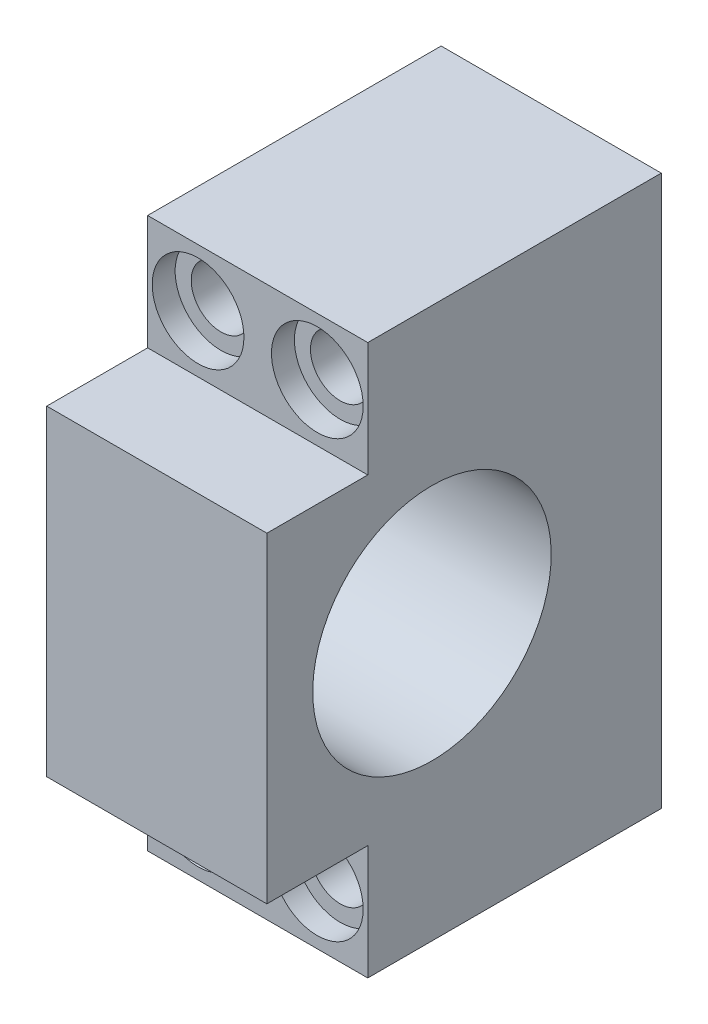
ISO-10303-21;
HEADER;
FILE_DESCRIPTION(('STEP AP214'),'2;1');
FILE_NAME('part.step','',(''),(''),'','','');
FILE_SCHEMA(('AUTOMOTIVE_DESIGN { 1 0 10303 214 1 1 1 1 }'));
ENDSEC;
DATA;
#1=APPLICATION_CONTEXT('core data for automotive mechanical design processes');
#2=APPLICATION_PROTOCOL_DEFINITION('international standard','automotive_design',2000,#1);
#3=PRODUCT_CONTEXT('',#1,'mechanical');
#4=PRODUCT('Part','Part','',(#3));
#5=PRODUCT_RELATED_PRODUCT_CATEGORY('part','',(#4));
#6=PRODUCT_DEFINITION_FORMATION('','',#4);
#7=PRODUCT_DEFINITION_CONTEXT('part definition',#1,'design');
#8=PRODUCT_DEFINITION('design','',#6,#7);
#9=PRODUCT_DEFINITION_SHAPE('','',#8);
#10=(LENGTH_UNIT() NAMED_UNIT(*) SI_UNIT(.MILLI.,.METRE.));
#11=(NAMED_UNIT(*) PLANE_ANGLE_UNIT() SI_UNIT($,.RADIAN.));
#12=(NAMED_UNIT(*) SI_UNIT($,.STERADIAN.) SOLID_ANGLE_UNIT());
#13=UNCERTAINTY_MEASURE_WITH_UNIT(LENGTH_MEASURE(1.E-05),#10,'distance_accuracy_value','');
#14=(GEOMETRIC_REPRESENTATION_CONTEXT(3) GLOBAL_UNCERTAINTY_ASSIGNED_CONTEXT((#13)) GLOBAL_UNIT_ASSIGNED_CONTEXT((#10,
#11,#12)) REPRESENTATION_CONTEXT('',''));
#15=CARTESIAN_POINT('',(0.,0.,0.));
#16=DIRECTION('',(0.,0.,1.));
#17=DIRECTION('',(1.,0.,0.));
#18=AXIS2_PLACEMENT_3D('',#15,#16,#17);
#19=CARTESIAN_POINT('',(-6.5,-23.75,0.));
#20=DIRECTION('',(0.,0.,1.));
#21=DIRECTION('',(1.,0.,0.));
#22=AXIS2_PLACEMENT_3D('',#19,#20,#21);
#23=CYLINDRICAL_SURFACE('',#22,3.25);
#24=CARTESIAN_POINT('',(-6.5,-23.75,0.));
#25=DIRECTION('',(0.,0.,1.));
#26=DIRECTION('',(1.,0.,0.));
#27=AXIS2_PLACEMENT_3D('',#24,#25,#26);
#28=CIRCLE('',#27,3.25);
#29=CARTESIAN_POINT('',(-3.25,-23.75,0.));
#30=VERTEX_POINT('',#29);
#31=EDGE_CURVE('E181',#30,#30,#28,.T.);
#32=ORIENTED_EDGE('',*,*,#31,.F.);
#33=EDGE_LOOP('',(#32));
#34=FACE_BOUND('',#33,.T.);
#35=CARTESIAN_POINT('',(-6.5,-23.75,29.5));
#36=DIRECTION('',(0.,0.,1.));
#37=DIRECTION('',(1.,0.,0.));
#38=AXIS2_PLACEMENT_3D('',#35,#36,#37);
#39=CIRCLE('',#38,3.25);
#40=CARTESIAN_POINT('',(-3.25,-23.75,29.5));
#41=VERTEX_POINT('',#40);
#42=EDGE_CURVE('E48',#41,#41,#39,.F.);
#43=ORIENTED_EDGE('',*,*,#42,.F.);
#44=EDGE_LOOP('',(#43));
#45=FACE_BOUND('',#44,.T.);
#46=ADVANCED_FACE('F44',(#34,#45),#23,.F.);
#47=CARTESIAN_POINT('',(6.5,-23.75,0.));
#48=DIRECTION('',(0.,0.,1.));
#49=DIRECTION('',(1.,0.,0.));
#50=AXIS2_PLACEMENT_3D('',#47,#48,#49);
#51=CYLINDRICAL_SURFACE('',#50,3.25);
#52=CARTESIAN_POINT('',(6.5,-23.75,0.));
#53=DIRECTION('',(0.,0.,1.));
#54=DIRECTION('',(1.,0.,0.));
#55=AXIS2_PLACEMENT_3D('',#52,#53,#54);
#56=CIRCLE('',#55,3.25);
#57=CARTESIAN_POINT('',(9.75000000000001,-23.75,0.));
#58=VERTEX_POINT('',#57);
#59=EDGE_CURVE('E173',#58,#58,#56,.T.);
#60=ORIENTED_EDGE('',*,*,#59,.F.);
#61=EDGE_LOOP('',(#60));
#62=FACE_BOUND('',#61,.T.);
#63=CARTESIAN_POINT('',(6.5,-23.75,29.5));
#64=DIRECTION('',(0.,0.,1.));
#65=DIRECTION('',(1.,0.,0.));
#66=AXIS2_PLACEMENT_3D('',#63,#64,#65);
#67=CIRCLE('',#66,3.25);
#68=CARTESIAN_POINT('',(9.75000000000001,-23.75,29.5));
#69=VERTEX_POINT('',#68);
#70=EDGE_CURVE('E155',#69,#69,#67,.F.);
#71=ORIENTED_EDGE('',*,*,#70,.F.);
#72=EDGE_LOOP('',(#71));
#73=FACE_BOUND('',#72,.T.);
#74=ADVANCED_FACE('F271',(#62,#73),#51,.F.);
#75=CARTESIAN_POINT('',(6.5,23.75,0.));
#76=DIRECTION('',(0.,0.,1.));
#77=DIRECTION('',(1.,0.,0.));
#78=AXIS2_PLACEMENT_3D('',#75,#76,#77);
#79=CYLINDRICAL_SURFACE('',#78,3.25);
#80=CARTESIAN_POINT('',(6.5,23.75,0.));
#81=DIRECTION('',(0.,0.,1.));
#82=DIRECTION('',(1.,0.,0.));
#83=AXIS2_PLACEMENT_3D('',#80,#81,#82);
#84=CIRCLE('',#83,3.25);
#85=CARTESIAN_POINT('',(9.75000000000001,23.75,0.));
#86=VERTEX_POINT('',#85);
#87=EDGE_CURVE('E162',#86,#86,#84,.T.);
#88=ORIENTED_EDGE('',*,*,#87,.F.);
#89=EDGE_LOOP('',(#88));
#90=FACE_BOUND('',#89,.T.);
#91=CARTESIAN_POINT('',(6.5,23.75,29.5));
#92=DIRECTION('',(0.,0.,1.));
#93=DIRECTION('',(1.,0.,0.));
#94=AXIS2_PLACEMENT_3D('',#91,#92,#93);
#95=CIRCLE('',#94,3.25);
#96=CARTESIAN_POINT('',(9.75000000000001,23.75,29.5));
#97=VERTEX_POINT('',#96);
#98=EDGE_CURVE('E151',#97,#97,#95,.F.);
#99=ORIENTED_EDGE('',*,*,#98,.F.);
#100=EDGE_LOOP('',(#99));
#101=FACE_BOUND('',#100,.T.);
#102=ADVANCED_FACE('F266',(#90,#101),#79,.F.);
#103=CARTESIAN_POINT('',(-6.5,23.75,0.));
#104=DIRECTION('',(0.,0.,1.));
#105=DIRECTION('',(1.,0.,0.));
#106=AXIS2_PLACEMENT_3D('',#103,#104,#105);
#107=CYLINDRICAL_SURFACE('',#106,3.25);
#108=CARTESIAN_POINT('',(-6.5,23.75,0.));
#109=DIRECTION('',(0.,0.,1.));
#110=DIRECTION('',(1.,0.,0.));
#111=AXIS2_PLACEMENT_3D('',#108,#109,#110);
#112=CIRCLE('',#111,3.25);
#113=CARTESIAN_POINT('',(-3.25,23.75,0.));
#114=VERTEX_POINT('',#113);
#115=EDGE_CURVE('E167',#114,#114,#112,.T.);
#116=ORIENTED_EDGE('',*,*,#115,.F.);
#117=EDGE_LOOP('',(#116));
#118=FACE_BOUND('',#117,.T.);
#119=CARTESIAN_POINT('',(-6.5,23.75,29.5));
#120=DIRECTION('',(0.,0.,1.));
#121=DIRECTION('',(1.,0.,0.));
#122=AXIS2_PLACEMENT_3D('',#119,#120,#121);
#123=CIRCLE('',#122,3.25);
#124=CARTESIAN_POINT('',(-3.25,23.75,29.5));
#125=VERTEX_POINT('',#124);
#126=EDGE_CURVE('E147',#125,#125,#123,.F.);
#127=ORIENTED_EDGE('',*,*,#126,.F.);
#128=EDGE_LOOP('',(#127));
#129=FACE_BOUND('',#128,.T.);
#130=ADVANCED_FACE('F259',(#118,#129),#107,.F.);
#131=CARTESIAN_POINT('',(-12.,30.,43.));
#132=DIRECTION('',(0.,-1.,0.));
#133=DIRECTION('',(0.,0.,-1.));
#134=AXIS2_PLACEMENT_3D('',#131,#132,#133);
#135=PLANE('',#134);
#136=DIRECTION('',(-1.,0.,0.));
#137=VECTOR('',#136,1.);
#138=CARTESIAN_POINT('',(-12.,30.,32.));
#139=LINE('',#138,#137);
#140=CARTESIAN_POINT('',(12.,30.,32.));
#141=VERTEX_POINT('',#140);
#142=CARTESIAN_POINT('',(-12.,30.,32.));
#143=VERTEX_POINT('',#142);
#144=EDGE_CURVE('E202',#141,#143,#139,.T.);
#145=ORIENTED_EDGE('',*,*,#144,.F.);
#146=DIRECTION('',(0.,0.,-1.));
#147=VECTOR('',#146,1.);
#148=CARTESIAN_POINT('',(12.,30.,43.));
#149=LINE('',#148,#147);
#150=CARTESIAN_POINT('',(12.,30.,0.));
#151=VERTEX_POINT('',#150);
#152=EDGE_CURVE('E11',#141,#151,#149,.T.);
#153=ORIENTED_EDGE('',*,*,#152,.T.);
#154=DIRECTION('',(-1.,0.,0.));
#155=VECTOR('',#154,1.);
#156=CARTESIAN_POINT('',(-12.,30.,0.));
#157=LINE('',#156,#155);
#158=CARTESIAN_POINT('',(-12.,30.,0.));
#159=VERTEX_POINT('',#158);
#160=EDGE_CURVE('E232',#151,#159,#157,.T.);
#161=ORIENTED_EDGE('',*,*,#160,.T.);
#162=DIRECTION('',(0.,0.,-1.));
#163=VECTOR('',#162,1.);
#164=CARTESIAN_POINT('',(-12.,30.,43.));
#165=LINE('',#164,#163);
#166=EDGE_CURVE('E54',#143,#159,#165,.T.);
#167=ORIENTED_EDGE('',*,*,#166,.F.);
#168=EDGE_LOOP('',(#145,#153,#161,#167));
#169=FACE_BOUND('',#168,.T.);
#170=ADVANCED_FACE('F257',(#169),#135,.F.);
#171=CARTESIAN_POINT('',(12.,30.,43.));
#172=DIRECTION('',(-1.,0.,0.));
#173=DIRECTION('',(0.,-1.,0.));
#174=AXIS2_PLACEMENT_3D('',#171,#172,#173);
#175=PLANE('',#174);
#176=CARTESIAN_POINT('',(12.,0.,25.));
#177=DIRECTION('',(1.,0.,0.));
#178=DIRECTION('',(0.,1.,0.));
#179=AXIS2_PLACEMENT_3D('',#176,#177,#178);
#180=CIRCLE('',#179,13.);
#181=CARTESIAN_POINT('',(12.,13.,25.));
#182=VERTEX_POINT('',#181);
#183=EDGE_CURVE('E309',#182,#182,#180,.T.);
#184=ORIENTED_EDGE('',*,*,#183,.F.);
#185=EDGE_LOOP('',(#184));
#186=FACE_BOUND('',#185,.T.);
#187=DIRECTION('',(0.,1.,0.));
#188=VECTOR('',#187,1.);
#189=CARTESIAN_POINT('',(12.,30.,43.));
#190=LINE('',#189,#188);
#191=CARTESIAN_POINT('',(12.,-17.5,43.));
#192=VERTEX_POINT('',#191);
#193=CARTESIAN_POINT('',(12.,17.5,43.));
#194=VERTEX_POINT('',#193);
#195=EDGE_CURVE('E221',#192,#194,#190,.T.);
#196=ORIENTED_EDGE('',*,*,#195,.F.);
#197=DIRECTION('',(0.,0.,1.));
#198=VECTOR('',#197,1.);
#199=CARTESIAN_POINT('',(12.,-17.5,32.));
#200=LINE('',#199,#198);
#201=CARTESIAN_POINT('',(12.,-17.5,32.));
#202=VERTEX_POINT('',#201);
#203=EDGE_CURVE('E70',#202,#192,#200,.T.);
#204=ORIENTED_EDGE('',*,*,#203,.F.);
#205=DIRECTION('',(0.,1.,0.));
#206=VECTOR('',#205,1.);
#207=CARTESIAN_POINT('',(12.,-30.,32.));
#208=LINE('',#207,#206);
#209=CARTESIAN_POINT('',(12.,-30.,32.));
#210=VERTEX_POINT('',#209);
#211=EDGE_CURVE('E132',#210,#202,#208,.T.);
#212=ORIENTED_EDGE('',*,*,#211,.F.);
#213=DIRECTION('',(0.,0.,-1.));
#214=VECTOR('',#213,1.);
#215=CARTESIAN_POINT('',(12.,-30.,43.));
#216=LINE('',#215,#214);
#217=CARTESIAN_POINT('',(12.,-30.,0.));
#218=VERTEX_POINT('',#217);
#219=EDGE_CURVE('E130',#210,#218,#216,.T.);
#220=ORIENTED_EDGE('',*,*,#219,.T.);
#221=DIRECTION('',(0.,1.,0.));
#222=VECTOR('',#221,1.);
#223=CARTESIAN_POINT('',(12.,30.,0.));
#224=LINE('',#223,#222);
#225=EDGE_CURVE('E197',#218,#151,#224,.T.);
#226=ORIENTED_EDGE('',*,*,#225,.T.);
#227=ORIENTED_EDGE('',*,*,#152,.F.);
#228=DIRECTION('',(0.,1.,0.));
#229=VECTOR('',#228,1.);
#230=CARTESIAN_POINT('',(12.,30.,32.));
#231=LINE('',#230,#229);
#232=CARTESIAN_POINT('',(12.,17.5,32.));
#233=VERTEX_POINT('',#232);
#234=EDGE_CURVE('E211',#233,#141,#231,.T.);
#235=ORIENTED_EDGE('',*,*,#234,.F.);
#236=DIRECTION('',(0.,0.,1.));
#237=VECTOR('',#236,1.);
#238=CARTESIAN_POINT('',(12.,17.5,32.));
#239=LINE('',#238,#237);
#240=EDGE_CURVE('E185',#233,#194,#239,.T.);
#241=ORIENTED_EDGE('',*,*,#240,.T.);
#242=EDGE_LOOP('',(#196,#204,#212,#220,#226,#227,#235,#241));
#243=FACE_BOUND('',#242,.T.);
#244=ADVANCED_FACE('F46',(#186,#243),#175,.F.);
#245=CARTESIAN_POINT('',(-12.,30.,43.));
#246=DIRECTION('',(1.,0.,0.));
#247=DIRECTION('',(0.,1.,0.));
#248=AXIS2_PLACEMENT_3D('',#245,#246,#247);
#249=PLANE('',#248);
#250=CARTESIAN_POINT('',(-12.,0.,25.));
#251=DIRECTION('',(1.,0.,0.));
#252=DIRECTION('',(0.,1.,0.));
#253=AXIS2_PLACEMENT_3D('',#250,#251,#252);
#254=CIRCLE('',#253,13.);
#255=CARTESIAN_POINT('',(-12.,13.,25.));
#256=VERTEX_POINT('',#255);
#257=EDGE_CURVE('E305',#256,#256,#254,.T.);
#258=ORIENTED_EDGE('',*,*,#257,.T.);
#259=EDGE_LOOP('',(#258));
#260=FACE_BOUND('',#259,.T.);
#261=DIRECTION('',(0.,-1.,0.));
#262=VECTOR('',#261,1.);
#263=CARTESIAN_POINT('',(-12.,-30.,32.));
#264=LINE('',#263,#262);
#265=CARTESIAN_POINT('',(-12.,-17.5,32.));
#266=VERTEX_POINT('',#265);
#267=CARTESIAN_POINT('',(-12.,-30.,32.));
#268=VERTEX_POINT('',#267);
#269=EDGE_CURVE('E112',#266,#268,#264,.T.);
#270=ORIENTED_EDGE('',*,*,#269,.F.);
#271=DIRECTION('',(0.,0.,1.));
#272=VECTOR('',#271,1.);
#273=CARTESIAN_POINT('',(-12.,-17.5,32.));
#274=LINE('',#273,#272);
#275=CARTESIAN_POINT('',(-12.,-17.5,43.));
#276=VERTEX_POINT('',#275);
#277=EDGE_CURVE('E194',#266,#276,#274,.T.);
#278=ORIENTED_EDGE('',*,*,#277,.T.);
#279=DIRECTION('',(0.,-1.,0.));
#280=VECTOR('',#279,1.);
#281=CARTESIAN_POINT('',(-12.,30.,43.));
#282=LINE('',#281,#280);
#283=CARTESIAN_POINT('',(-12.,17.5,43.));
#284=VERTEX_POINT('',#283);
#285=EDGE_CURVE('E143',#284,#276,#282,.T.);
#286=ORIENTED_EDGE('',*,*,#285,.F.);
#287=DIRECTION('',(0.,0.,1.));
#288=VECTOR('',#287,1.);
#289=CARTESIAN_POINT('',(-12.,17.5,32.));
#290=LINE('',#289,#288);
#291=CARTESIAN_POINT('',(-12.,17.5,32.));
#292=VERTEX_POINT('',#291);
#293=EDGE_CURVE('E62',#292,#284,#290,.T.);
#294=ORIENTED_EDGE('',*,*,#293,.F.);
#295=DIRECTION('',(0.,-1.,0.));
#296=VECTOR('',#295,1.);
#297=CARTESIAN_POINT('',(-12.,30.,32.));
#298=LINE('',#297,#296);
#299=EDGE_CURVE('E208',#143,#292,#298,.T.);
#300=ORIENTED_EDGE('',*,*,#299,.F.);
#301=ORIENTED_EDGE('',*,*,#166,.T.);
#302=DIRECTION('',(0.,-1.,0.));
#303=VECTOR('',#302,1.);
#304=CARTESIAN_POINT('',(-12.,30.,0.));
#305=LINE('',#304,#303);
#306=CARTESIAN_POINT('',(-12.,-30.,0.));
#307=VERTEX_POINT('',#306);
#308=EDGE_CURVE('E136',#159,#307,#305,.T.);
#309=ORIENTED_EDGE('',*,*,#308,.T.);
#310=DIRECTION('',(0.,0.,-1.));
#311=VECTOR('',#310,1.);
#312=CARTESIAN_POINT('',(-12.,-30.,43.));
#313=LINE('',#312,#311);
#314=EDGE_CURVE('E128',#268,#307,#313,.T.);
#315=ORIENTED_EDGE('',*,*,#314,.F.);
#316=EDGE_LOOP('',(#270,#278,#286,#294,#300,#301,#309,#315));
#317=FACE_BOUND('',#316,.T.);
#318=ADVANCED_FACE('F134',(#260,#317),#249,.F.);
#319=CARTESIAN_POINT('',(-12.,-30.,43.));
#320=DIRECTION('',(0.,1.,0.));
#321=DIRECTION('',(0.,0.,1.));
#322=AXIS2_PLACEMENT_3D('',#319,#320,#321);
#323=PLANE('',#322);
#324=ORIENTED_EDGE('',*,*,#219,.F.);
#325=DIRECTION('',(1.,0.,0.));
#326=VECTOR('',#325,1.);
#327=CARTESIAN_POINT('',(-12.,-30.,32.));
#328=LINE('',#327,#326);
#329=EDGE_CURVE('E115',#268,#210,#328,.T.);
#330=ORIENTED_EDGE('',*,*,#329,.F.);
#331=ORIENTED_EDGE('',*,*,#314,.T.);
#332=DIRECTION('',(1.,0.,0.));
#333=VECTOR('',#332,1.);
#334=CARTESIAN_POINT('',(-12.,-30.,0.));
#335=LINE('',#334,#333);
#336=EDGE_CURVE('E225',#307,#218,#335,.T.);
#337=ORIENTED_EDGE('',*,*,#336,.T.);
#338=EDGE_LOOP('',(#324,#330,#331,#337));
#339=FACE_BOUND('',#338,.T.);
#340=ADVANCED_FACE('F126',(#339),#323,.F.);
#341=CARTESIAN_POINT('',(0.,0.,43.));
#342=DIRECTION('',(0.,0.,1.));
#343=DIRECTION('',(1.,0.,0.));
#344=AXIS2_PLACEMENT_3D('',#341,#342,#343);
#345=PLANE('',#344);
#346=DIRECTION('',(-1.,0.,0.));
#347=VECTOR('',#346,1.);
#348=CARTESIAN_POINT('',(-12.,-17.5,43.));
#349=LINE('',#348,#347);
#350=EDGE_CURVE('E122',#192,#276,#349,.T.);
#351=ORIENTED_EDGE('',*,*,#350,.F.);
#352=ORIENTED_EDGE('',*,*,#195,.T.);
#353=DIRECTION('',(1.,0.,0.));
#354=VECTOR('',#353,1.);
#355=CARTESIAN_POINT('',(-12.,17.5,43.));
#356=LINE('',#355,#354);
#357=EDGE_CURVE('E193',#284,#194,#356,.T.);
#358=ORIENTED_EDGE('',*,*,#357,.F.);
#359=ORIENTED_EDGE('',*,*,#285,.T.);
#360=EDGE_LOOP('',(#351,#352,#358,#359));
#361=FACE_BOUND('',#360,.T.);
#362=ADVANCED_FACE('F249',(#361),#345,.T.);
#363=CARTESIAN_POINT('',(0.,0.,0.));
#364=DIRECTION('',(0.,0.,1.));
#365=DIRECTION('',(1.,0.,0.));
#366=AXIS2_PLACEMENT_3D('',#363,#364,#365);
#367=PLANE('',#366);
#368=ORIENTED_EDGE('',*,*,#59,.T.);
#369=EDGE_LOOP('',(#368));
#370=FACE_BOUND('',#369,.T.);
#371=ORIENTED_EDGE('',*,*,#115,.T.);
#372=EDGE_LOOP('',(#371));
#373=FACE_BOUND('',#372,.T.);
#374=ORIENTED_EDGE('',*,*,#87,.T.);
#375=EDGE_LOOP('',(#374));
#376=FACE_BOUND('',#375,.T.);
#377=ORIENTED_EDGE('',*,*,#31,.T.);
#378=EDGE_LOOP('',(#377));
#379=FACE_BOUND('',#378,.T.);
#380=ORIENTED_EDGE('',*,*,#225,.F.);
#381=ORIENTED_EDGE('',*,*,#336,.F.);
#382=ORIENTED_EDGE('',*,*,#308,.F.);
#383=ORIENTED_EDGE('',*,*,#160,.F.);
#384=EDGE_LOOP('',(#380,#381,#382,#383));
#385=FACE_BOUND('',#384,.T.);
#386=ADVANCED_FACE('F241',(#370,#373,#376,#379,#385),#367,.F.);
#387=CARTESIAN_POINT('',(-12.,17.5,32.));
#388=DIRECTION('',(0.,-1.,0.));
#389=DIRECTION('',(1.,0.,0.));
#390=AXIS2_PLACEMENT_3D('',#387,#388,#389);
#391=PLANE('',#390);
#392=ORIENTED_EDGE('',*,*,#357,.T.);
#393=ORIENTED_EDGE('',*,*,#240,.F.);
#394=DIRECTION('',(1.,0.,0.));
#395=VECTOR('',#394,1.);
#396=CARTESIAN_POINT('',(-12.,17.5,32.));
#397=LINE('',#396,#395);
#398=EDGE_CURVE('E214',#292,#233,#397,.T.);
#399=ORIENTED_EDGE('',*,*,#398,.F.);
#400=ORIENTED_EDGE('',*,*,#293,.T.);
#401=EDGE_LOOP('',(#392,#393,#399,#400));
#402=FACE_BOUND('',#401,.T.);
#403=ADVANCED_FACE('F250',(#402),#391,.F.);
#404=CARTESIAN_POINT('',(0.,0.,32.));
#405=DIRECTION('',(0.,0.,1.));
#406=DIRECTION('',(1.,0.,0.));
#407=AXIS2_PLACEMENT_3D('',#404,#405,#406);
#408=PLANE('',#407);
#409=CARTESIAN_POINT('',(6.5,23.75,32.));
#410=DIRECTION('',(0.,0.,1.));
#411=DIRECTION('',(1.,0.,0.));
#412=AXIS2_PLACEMENT_3D('',#409,#410,#411);
#413=CIRCLE('',#412,5.);
#414=CARTESIAN_POINT('',(11.5,23.75,32.));
#415=VERTEX_POINT('',#414);
#416=EDGE_CURVE('E323',#415,#415,#413,.T.);
#417=ORIENTED_EDGE('',*,*,#416,.F.);
#418=EDGE_LOOP('',(#417));
#419=FACE_BOUND('',#418,.T.);
#420=CARTESIAN_POINT('',(-6.5,23.75,32.));
#421=DIRECTION('',(0.,0.,1.));
#422=DIRECTION('',(1.,0.,0.));
#423=AXIS2_PLACEMENT_3D('',#420,#421,#422);
#424=CIRCLE('',#423,5.);
#425=CARTESIAN_POINT('',(-1.5,23.75,32.));
#426=VERTEX_POINT('',#425);
#427=EDGE_CURVE('E177',#426,#426,#424,.T.);
#428=ORIENTED_EDGE('',*,*,#427,.F.);
#429=EDGE_LOOP('',(#428));
#430=FACE_BOUND('',#429,.T.);
#431=ORIENTED_EDGE('',*,*,#299,.T.);
#432=ORIENTED_EDGE('',*,*,#398,.T.);
#433=ORIENTED_EDGE('',*,*,#234,.T.);
#434=ORIENTED_EDGE('',*,*,#144,.T.);
#435=EDGE_LOOP('',(#431,#432,#433,#434));
#436=FACE_BOUND('',#435,.T.);
#437=ADVANCED_FACE('F253',(#419,#430,#436),#408,.T.);
#438=CARTESIAN_POINT('',(-12.,-17.5,32.));
#439=DIRECTION('',(0.,1.,0.));
#440=DIRECTION('',(0.,0.,1.));
#441=AXIS2_PLACEMENT_3D('',#438,#439,#440);
#442=PLANE('',#441);
#443=ORIENTED_EDGE('',*,*,#350,.T.);
#444=ORIENTED_EDGE('',*,*,#277,.F.);
#445=DIRECTION('',(-1.,0.,0.));
#446=VECTOR('',#445,1.);
#447=CARTESIAN_POINT('',(-12.,-17.5,32.));
#448=LINE('',#447,#446);
#449=EDGE_CURVE('E117',#202,#266,#448,.T.);
#450=ORIENTED_EDGE('',*,*,#449,.F.);
#451=ORIENTED_EDGE('',*,*,#203,.T.);
#452=EDGE_LOOP('',(#443,#444,#450,#451));
#453=FACE_BOUND('',#452,.T.);
#454=ADVANCED_FACE('F246',(#453),#442,.F.);
#455=CARTESIAN_POINT('',(0.,0.,32.));
#456=DIRECTION('',(0.,0.,-1.));
#457=DIRECTION('',(-1.,0.,0.));
#458=AXIS2_PLACEMENT_3D('',#455,#456,#457);
#459=PLANE('',#458);
#460=CARTESIAN_POINT('',(-6.5,-23.75,32.));
#461=DIRECTION('',(0.,0.,1.));
#462=DIRECTION('',(1.,0.,0.));
#463=AXIS2_PLACEMENT_3D('',#460,#461,#462);
#464=CIRCLE('',#463,5.);
#465=CARTESIAN_POINT('',(-1.5,-23.75,32.));
#466=VERTEX_POINT('',#465);
#467=EDGE_CURVE('E331',#466,#466,#464,.T.);
#468=ORIENTED_EDGE('',*,*,#467,.F.);
#469=EDGE_LOOP('',(#468));
#470=FACE_BOUND('',#469,.T.);
#471=CARTESIAN_POINT('',(6.5,-23.75,32.));
#472=DIRECTION('',(0.,0.,1.));
#473=DIRECTION('',(1.,0.,0.));
#474=AXIS2_PLACEMENT_3D('',#471,#472,#473);
#475=CIRCLE('',#474,5.);
#476=CARTESIAN_POINT('',(11.5,-23.75,32.));
#477=VERTEX_POINT('',#476);
#478=EDGE_CURVE('E314',#477,#477,#475,.T.);
#479=ORIENTED_EDGE('',*,*,#478,.F.);
#480=EDGE_LOOP('',(#479));
#481=FACE_BOUND('',#480,.T.);
#482=ORIENTED_EDGE('',*,*,#269,.T.);
#483=ORIENTED_EDGE('',*,*,#329,.T.);
#484=ORIENTED_EDGE('',*,*,#211,.T.);
#485=ORIENTED_EDGE('',*,*,#449,.T.);
#486=EDGE_LOOP('',(#482,#483,#484,#485));
#487=FACE_BOUND('',#486,.T.);
#488=ADVANCED_FACE('F114',(#470,#481,#487),#459,.F.);
#489=CARTESIAN_POINT('',(-6.5,23.75,29.5));
#490=DIRECTION('',(0.,0.,1.));
#491=DIRECTION('',(1.,0.,0.));
#492=AXIS2_PLACEMENT_3D('',#489,#490,#491);
#493=PLANE('',#492);
#494=CARTESIAN_POINT('',(-6.5,23.75,29.5));
#495=DIRECTION('',(0.,0.,1.));
#496=DIRECTION('',(1.,0.,0.));
#497=AXIS2_PLACEMENT_3D('',#494,#495,#496);
#498=CIRCLE('',#497,5.);
#499=CARTESIAN_POINT('',(-1.5,23.75,29.5));
#500=VERTEX_POINT('',#499);
#501=EDGE_CURVE('E152',#500,#500,#498,.T.);
#502=ORIENTED_EDGE('',*,*,#501,.T.);
#503=EDGE_LOOP('',(#502));
#504=FACE_BOUND('',#503,.T.);
#505=ORIENTED_EDGE('',*,*,#126,.T.);
#506=EDGE_LOOP('',(#505));
#507=FACE_BOUND('',#506,.T.);
#508=ADVANCED_FACE('F285',(#504,#507),#493,.T.);
#509=CARTESIAN_POINT('',(-6.5,23.75,29.5));
#510=DIRECTION('',(0.,0.,1.));
#511=DIRECTION('',(1.,0.,0.));
#512=AXIS2_PLACEMENT_3D('',#509,#510,#511);
#513=CYLINDRICAL_SURFACE('',#512,5.);
#514=ORIENTED_EDGE('',*,*,#501,.F.);
#515=EDGE_LOOP('',(#514));
#516=FACE_BOUND('',#515,.T.);
#517=ORIENTED_EDGE('',*,*,#427,.T.);
#518=EDGE_LOOP('',(#517));
#519=FACE_BOUND('',#518,.T.);
#520=ADVANCED_FACE('F345',(#516,#519),#513,.F.);
#521=CARTESIAN_POINT('',(6.5,23.75,29.5));
#522=DIRECTION('',(0.,0.,1.));
#523=DIRECTION('',(1.,0.,0.));
#524=AXIS2_PLACEMENT_3D('',#521,#522,#523);
#525=PLANE('',#524);
#526=CARTESIAN_POINT('',(6.5,23.75,29.5));
#527=DIRECTION('',(0.,0.,1.));
#528=DIRECTION('',(1.,0.,0.));
#529=AXIS2_PLACEMENT_3D('',#526,#527,#528);
#530=CIRCLE('',#529,5.);
#531=CARTESIAN_POINT('',(11.5,23.75,29.5));
#532=VERTEX_POINT('',#531);
#533=EDGE_CURVE('E327',#532,#532,#530,.T.);
#534=ORIENTED_EDGE('',*,*,#533,.T.);
#535=EDGE_LOOP('',(#534));
#536=FACE_BOUND('',#535,.T.);
#537=ORIENTED_EDGE('',*,*,#98,.T.);
#538=EDGE_LOOP('',(#537));
#539=FACE_BOUND('',#538,.T.);
#540=ADVANCED_FACE('F348',(#536,#539),#525,.T.);
#541=CARTESIAN_POINT('',(6.5,23.75,29.5));
#542=DIRECTION('',(0.,0.,1.));
#543=DIRECTION('',(1.,0.,0.));
#544=AXIS2_PLACEMENT_3D('',#541,#542,#543);
#545=CYLINDRICAL_SURFACE('',#544,5.);
#546=ORIENTED_EDGE('',*,*,#533,.F.);
#547=EDGE_LOOP('',(#546));
#548=FACE_BOUND('',#547,.T.);
#549=ORIENTED_EDGE('',*,*,#416,.T.);
#550=EDGE_LOOP('',(#549));
#551=FACE_BOUND('',#550,.T.);
#552=ADVANCED_FACE('F355',(#548,#551),#545,.F.);
#553=CARTESIAN_POINT('',(6.5,-23.75,29.5));
#554=DIRECTION('',(0.,0.,1.));
#555=DIRECTION('',(1.,0.,0.));
#556=AXIS2_PLACEMENT_3D('',#553,#554,#555);
#557=PLANE('',#556);
#558=CARTESIAN_POINT('',(6.5,-23.75,29.5));
#559=DIRECTION('',(0.,0.,1.));
#560=DIRECTION('',(1.,0.,0.));
#561=AXIS2_PLACEMENT_3D('',#558,#559,#560);
#562=CIRCLE('',#561,5.);
#563=CARTESIAN_POINT('',(11.5,-23.75,29.5));
#564=VERTEX_POINT('',#563);
#565=EDGE_CURVE('E308',#564,#564,#562,.T.);
#566=ORIENTED_EDGE('',*,*,#565,.T.);
#567=EDGE_LOOP('',(#566));
#568=FACE_BOUND('',#567,.T.);
#569=ORIENTED_EDGE('',*,*,#70,.T.);
#570=EDGE_LOOP('',(#569));
#571=FACE_BOUND('',#570,.T.);
#572=ADVANCED_FACE('F414',(#568,#571),#557,.T.);
#573=CARTESIAN_POINT('',(6.5,-23.75,29.5));
#574=DIRECTION('',(0.,0.,1.));
#575=DIRECTION('',(1.,0.,0.));
#576=AXIS2_PLACEMENT_3D('',#573,#574,#575);
#577=CYLINDRICAL_SURFACE('',#576,5.);
#578=ORIENTED_EDGE('',*,*,#565,.F.);
#579=EDGE_LOOP('',(#578));
#580=FACE_BOUND('',#579,.T.);
#581=ORIENTED_EDGE('',*,*,#478,.T.);
#582=EDGE_LOOP('',(#581));
#583=FACE_BOUND('',#582,.T.);
#584=ADVANCED_FACE('F424',(#580,#583),#577,.F.);
#585=CARTESIAN_POINT('',(-6.5,-23.75,29.5));
#586=DIRECTION('',(0.,0.,1.));
#587=DIRECTION('',(1.,0.,0.));
#588=AXIS2_PLACEMENT_3D('',#585,#586,#587);
#589=PLANE('',#588);
#590=CARTESIAN_POINT('',(-6.5,-23.75,29.5));
#591=DIRECTION('',(0.,0.,1.));
#592=DIRECTION('',(1.,0.,0.));
#593=AXIS2_PLACEMENT_3D('',#590,#591,#592);
#594=CIRCLE('',#593,5.);
#595=CARTESIAN_POINT('',(-1.5,-23.75,29.5));
#596=VERTEX_POINT('',#595);
#597=EDGE_CURVE('E321',#596,#596,#594,.T.);
#598=ORIENTED_EDGE('',*,*,#597,.T.);
#599=EDGE_LOOP('',(#598));
#600=FACE_BOUND('',#599,.T.);
#601=ORIENTED_EDGE('',*,*,#42,.T.);
#602=EDGE_LOOP('',(#601));
#603=FACE_BOUND('',#602,.T.);
#604=ADVANCED_FACE('F434',(#600,#603),#589,.T.);
#605=CARTESIAN_POINT('',(-6.5,-23.75,29.5));
#606=DIRECTION('',(0.,0.,1.));
#607=DIRECTION('',(1.,0.,0.));
#608=AXIS2_PLACEMENT_3D('',#605,#606,#607);
#609=CYLINDRICAL_SURFACE('',#608,5.);
#610=ORIENTED_EDGE('',*,*,#597,.F.);
#611=EDGE_LOOP('',(#610));
#612=FACE_BOUND('',#611,.T.);
#613=ORIENTED_EDGE('',*,*,#467,.T.);
#614=EDGE_LOOP('',(#613));
#615=FACE_BOUND('',#614,.T.);
#616=ADVANCED_FACE('F444',(#612,#615),#609,.F.);
#617=CARTESIAN_POINT('',(-12.,0.,25.));
#618=DIRECTION('',(1.,0.,0.));
#619=DIRECTION('',(0.,1.,0.));
#620=AXIS2_PLACEMENT_3D('',#617,#618,#619);
#621=CYLINDRICAL_SURFACE('',#620,13.);
#622=ORIENTED_EDGE('',*,*,#257,.F.);
#623=EDGE_LOOP('',(#622));
#624=FACE_BOUND('',#623,.T.);
#625=ORIENTED_EDGE('',*,*,#183,.T.);
#626=EDGE_LOOP('',(#625));
#627=FACE_BOUND('',#626,.T.);
#628=ADVANCED_FACE('F453',(#624,#627),#621,.F.);
#629=CLOSED_SHELL('',(#46,#74,#102,#130,#170,#244,#318,#340,#362,#386,#403,#437,#454,#488,#508,
#520,#540,#552,#572,#584,#604,#616,#628));
#630=MANIFOLD_SOLID_BREP('B2',#629);
#631=ADVANCED_BREP_SHAPE_REPRESENTATION('',(#18,#630),#14);
#632=SHAPE_DEFINITION_REPRESENTATION(#9,#631);
ENDSEC;
END-ISO-10303-21;
